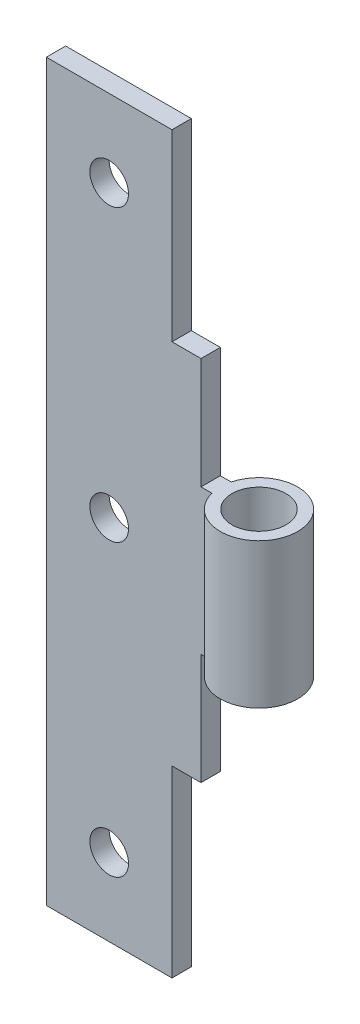
ISO-10303-21;
HEADER;
FILE_DESCRIPTION(('STEP AP214'),'2;1');
FILE_NAME('part.step','',(''),(''),'','','');
FILE_SCHEMA(('AUTOMOTIVE_DESIGN { 1 0 10303 214 1 1 1 1 }'));
ENDSEC;
DATA;
#1=APPLICATION_CONTEXT('core data for automotive mechanical design processes');
#2=APPLICATION_PROTOCOL_DEFINITION('international standard','automotive_design',2000,#1);
#3=PRODUCT_CONTEXT('',#1,'mechanical');
#4=PRODUCT('Part','Part','',(#3));
#5=PRODUCT_RELATED_PRODUCT_CATEGORY('part','',(#4));
#6=PRODUCT_DEFINITION_FORMATION('','',#4);
#7=PRODUCT_DEFINITION_CONTEXT('part definition',#1,'design');
#8=PRODUCT_DEFINITION('design','',#6,#7);
#9=PRODUCT_DEFINITION_SHAPE('','',#8);
#10=(LENGTH_UNIT() NAMED_UNIT(*) SI_UNIT(.MILLI.,.METRE.));
#11=(NAMED_UNIT(*) PLANE_ANGLE_UNIT() SI_UNIT($,.RADIAN.));
#12=(NAMED_UNIT(*) SI_UNIT($,.STERADIAN.) SOLID_ANGLE_UNIT());
#13=UNCERTAINTY_MEASURE_WITH_UNIT(LENGTH_MEASURE(1.E-05),#10,'distance_accuracy_value','');
#14=(GEOMETRIC_REPRESENTATION_CONTEXT(3) GLOBAL_UNCERTAINTY_ASSIGNED_CONTEXT((#13)) GLOBAL_UNIT_ASSIGNED_CONTEXT((#10,
#11,#12)) REPRESENTATION_CONTEXT('',''));
#15=CARTESIAN_POINT('',(0.,0.,0.));
#16=DIRECTION('',(0.,0.,1.));
#17=DIRECTION('',(1.,0.,0.));
#18=AXIS2_PLACEMENT_3D('',#15,#16,#17);
#19=CARTESIAN_POINT('',(4.25,0.,0.));
#20=DIRECTION('',(0.,1.,0.));
#21=DIRECTION('',(0.,0.,1.));
#22=AXIS2_PLACEMENT_3D('',#19,#20,#21);
#23=PLANE('',#22);
#24=CARTESIAN_POINT('',(4.25,0.,0.));
#25=DIRECTION('',(0.,1.,0.));
#26=DIRECTION('',(0.,0.,1.));
#27=AXIS2_PLACEMENT_3D('',#24,#25,#26);
#28=CIRCLE('',#27,1.4);
#29=CARTESIAN_POINT('',(4.25,0.,1.4));
#30=VERTEX_POINT('',#29);
#31=EDGE_CURVE('E195',#30,#30,#28,.T.);
#32=ORIENTED_EDGE('',*,*,#31,.T.);
#33=EDGE_LOOP('',(#32));
#34=FACE_BOUND('',#33,.T.);
#35=DIRECTION('',(0.,0.,1.));
#36=VECTOR('',#35,1.);
#37=CARTESIAN_POINT('',(1.75,0.,-0.499999999999999));
#38=LINE('',#37,#36);
#39=CARTESIAN_POINT('',(1.75,0.,-0.499999999999998));
#40=VERTEX_POINT('',#39);
#41=CARTESIAN_POINT('',(1.75,0.,0.500000000000001));
#42=VERTEX_POINT('',#41);
#43=EDGE_CURVE('E166',#40,#42,#38,.T.);
#44=ORIENTED_EDGE('',*,*,#43,.F.);
#45=DIRECTION('',(-1.,0.,0.));
#46=VECTOR('',#45,1.);
#47=CARTESIAN_POINT('',(2.31350832689629,0.,-0.499999999999998));
#48=LINE('',#47,#46);
#49=CARTESIAN_POINT('',(2.31350832689629,0.,-0.499999999999998));
#50=VERTEX_POINT('',#49);
#51=EDGE_CURVE('E213',#50,#40,#48,.T.);
#52=ORIENTED_EDGE('',*,*,#51,.F.);
#53=CARTESIAN_POINT('',(4.25,0.,0.));
#54=DIRECTION('',(0.,1.,0.));
#55=DIRECTION('',(0.,0.,1.));
#56=AXIS2_PLACEMENT_3D('',#53,#54,#55);
#57=CIRCLE('',#56,2.);
#58=CARTESIAN_POINT('',(2.31350832689629,0.,0.499999999999998));
#59=VERTEX_POINT('',#58);
#60=EDGE_CURVE('E199',#59,#50,#57,.T.);
#61=ORIENTED_EDGE('',*,*,#60,.F.);
#62=DIRECTION('',(1.,0.,0.));
#63=VECTOR('',#62,1.);
#64=CARTESIAN_POINT('',(2.31350832689629,0.,0.499999999999998));
#65=LINE('',#64,#63);
#66=EDGE_CURVE('E206',#42,#59,#65,.T.);
#67=ORIENTED_EDGE('',*,*,#66,.F.);
#68=EDGE_LOOP('',(#44,#52,#61,#67));
#69=FACE_BOUND('',#68,.T.);
#70=ADVANCED_FACE('F32',(#34,#69),#23,.F.);
#71=CARTESIAN_POINT('',(4.25,7.5,0.));
#72=DIRECTION('',(0.,1.,0.));
#73=DIRECTION('',(0.,0.,1.));
#74=AXIS2_PLACEMENT_3D('',#71,#72,#73);
#75=PLANE('',#74);
#76=DIRECTION('',(0.,0.,-1.));
#77=VECTOR('',#76,1.);
#78=CARTESIAN_POINT('',(1.75,7.5,0.499999999999999));
#79=LINE('',#78,#77);
#80=CARTESIAN_POINT('',(1.75,7.5,0.499999999999998));
#81=VERTEX_POINT('',#80);
#82=CARTESIAN_POINT('',(1.75,7.5,-0.500000000000001));
#83=VERTEX_POINT('',#82);
#84=EDGE_CURVE('E181',#81,#83,#79,.T.);
#85=ORIENTED_EDGE('',*,*,#84,.F.);
#86=DIRECTION('',(1.,0.,0.));
#87=VECTOR('',#86,1.);
#88=CARTESIAN_POINT('',(2.31350832689629,7.5,0.499999999999998));
#89=LINE('',#88,#87);
#90=CARTESIAN_POINT('',(2.31350832689629,7.5,0.499999999999998));
#91=VERTEX_POINT('',#90);
#92=EDGE_CURVE('E208',#81,#91,#89,.T.);
#93=ORIENTED_EDGE('',*,*,#92,.T.);
#94=CARTESIAN_POINT('',(4.25,7.5,0.));
#95=DIRECTION('',(0.,1.,0.));
#96=DIRECTION('',(0.,0.,1.));
#97=AXIS2_PLACEMENT_3D('',#94,#95,#96);
#98=CIRCLE('',#97,2.);
#99=CARTESIAN_POINT('',(2.31350832689629,7.5,-0.499999999999998));
#100=VERTEX_POINT('',#99);
#101=EDGE_CURVE('E202',#91,#100,#98,.T.);
#102=ORIENTED_EDGE('',*,*,#101,.T.);
#103=DIRECTION('',(-1.,0.,0.));
#104=VECTOR('',#103,1.);
#105=CARTESIAN_POINT('',(2.31350832689629,7.5,-0.499999999999998));
#106=LINE('',#105,#104);
#107=EDGE_CURVE('E205',#100,#83,#106,.T.);
#108=ORIENTED_EDGE('',*,*,#107,.T.);
#109=EDGE_LOOP('',(#85,#93,#102,#108));
#110=FACE_BOUND('',#109,.T.);
#111=CARTESIAN_POINT('',(4.25,7.5,0.));
#112=DIRECTION('',(0.,1.,0.));
#113=DIRECTION('',(0.,0.,1.));
#114=AXIS2_PLACEMENT_3D('',#111,#112,#113);
#115=CIRCLE('',#114,1.4);
#116=CARTESIAN_POINT('',(4.25,7.5,1.4));
#117=VERTEX_POINT('',#116);
#118=EDGE_CURVE('E196',#117,#117,#115,.T.);
#119=ORIENTED_EDGE('',*,*,#118,.F.);
#120=EDGE_LOOP('',(#119));
#121=FACE_BOUND('',#120,.T.);
#122=ADVANCED_FACE('F301',(#110,#121),#75,.T.);
#123=CARTESIAN_POINT('',(4.25,7.5,0.));
#124=DIRECTION('',(0.,-1.,0.));
#125=DIRECTION('',(0.,0.,-1.));
#126=AXIS2_PLACEMENT_3D('',#123,#124,#125);
#127=CYLINDRICAL_SURFACE('',#126,2.);
#128=ORIENTED_EDGE('',*,*,#60,.T.);
#129=DIRECTION('',(0.,-1.,0.));
#130=VECTOR('',#129,1.);
#131=CARTESIAN_POINT('',(2.31350832689629,7.5,-0.499999999999998));
#132=LINE('',#131,#130);
#133=EDGE_CURVE('E11',#100,#50,#132,.T.);
#134=ORIENTED_EDGE('',*,*,#133,.F.);
#135=ORIENTED_EDGE('',*,*,#101,.F.);
#136=DIRECTION('',(0.,-1.,0.));
#137=VECTOR('',#136,1.);
#138=CARTESIAN_POINT('',(2.31350832689629,7.5,0.499999999999998));
#139=LINE('',#138,#137);
#140=EDGE_CURVE('E210',#91,#59,#139,.T.);
#141=ORIENTED_EDGE('',*,*,#140,.T.);
#142=EDGE_LOOP('',(#128,#134,#135,#141));
#143=FACE_BOUND('',#142,.T.);
#144=ADVANCED_FACE('F34',(#143),#127,.T.);
#145=CARTESIAN_POINT('',(2.31350832689629,7.5,-0.499999999999998));
#146=DIRECTION('',(0.,0.,1.));
#147=DIRECTION('',(1.,0.,0.));
#148=AXIS2_PLACEMENT_3D('',#145,#146,#147);
#149=PLANE('',#148);
#150=CARTESIAN_POINT('',(-3.,18.75,-0.499999999999999));
#151=DIRECTION('',(0.,0.,1.));
#152=DIRECTION('',(1.,0.,0.));
#153=AXIS2_PLACEMENT_3D('',#150,#151,#152);
#154=CIRCLE('',#153,1.);
#155=CARTESIAN_POINT('',(-2.,18.75,-0.499999999999999));
#156=VERTEX_POINT('',#155);
#157=EDGE_CURVE('E254',#156,#156,#154,.F.);
#158=ORIENTED_EDGE('',*,*,#157,.F.);
#159=EDGE_LOOP('',(#158));
#160=FACE_BOUND('',#159,.T.);
#161=CARTESIAN_POINT('',(-2.99999999999972,3.75,-0.499999999999999));
#162=DIRECTION('',(0.,0.,1.));
#163=DIRECTION('',(1.,0.,0.));
#164=AXIS2_PLACEMENT_3D('',#161,#162,#163);
#165=CIRCLE('',#164,1.);
#166=CARTESIAN_POINT('',(-1.99999999999972,3.75,-0.499999999999999));
#167=VERTEX_POINT('',#166);
#168=EDGE_CURVE('E265',#167,#167,#165,.F.);
#169=ORIENTED_EDGE('',*,*,#168,.F.);
#170=EDGE_LOOP('',(#169));
#171=FACE_BOUND('',#170,.T.);
#172=CARTESIAN_POINT('',(-2.99999999999945,-11.25,-0.499999999999999));
#173=DIRECTION('',(0.,0.,1.));
#174=DIRECTION('',(1.,0.,0.));
#175=AXIS2_PLACEMENT_3D('',#172,#173,#174);
#176=CIRCLE('',#175,1.);
#177=CARTESIAN_POINT('',(-1.99999999999945,-11.25,-0.499999999999999));
#178=VERTEX_POINT('',#177);
#179=EDGE_CURVE('E258',#178,#178,#176,.F.);
#180=ORIENTED_EDGE('',*,*,#179,.F.);
#181=EDGE_LOOP('',(#180));
#182=FACE_BOUND('',#181,.T.);
#183=ORIENTED_EDGE('',*,*,#51,.T.);
#184=DIRECTION('',(0.,1.,0.));
#185=VECTOR('',#184,1.);
#186=CARTESIAN_POINT('',(1.75,-5.75,-0.499999999999999));
#187=LINE('',#186,#185);
#188=CARTESIAN_POINT('',(1.75,-5.75,-0.499999999999999));
#189=VERTEX_POINT('',#188);
#190=EDGE_CURVE('E178',#189,#40,#187,.T.);
#191=ORIENTED_EDGE('',*,*,#190,.F.);
#192=DIRECTION('',(1.,0.,0.));
#193=VECTOR('',#192,1.);
#194=CARTESIAN_POINT('',(-6.25,-5.75,-0.5));
#195=LINE('',#194,#193);
#196=CARTESIAN_POINT('',(0.249999999999999,-5.75,-0.5));
#197=VERTEX_POINT('',#196);
#198=EDGE_CURVE('E167',#197,#189,#195,.T.);
#199=ORIENTED_EDGE('',*,*,#198,.F.);
#200=DIRECTION('',(0.,1.,0.));
#201=VECTOR('',#200,1.);
#202=CARTESIAN_POINT('',(0.249999999999999,-15.25,-0.5));
#203=LINE('',#202,#201);
#204=CARTESIAN_POINT('',(0.249999999999999,-15.25,-0.5));
#205=VERTEX_POINT('',#204);
#206=EDGE_CURVE('E163',#205,#197,#203,.T.);
#207=ORIENTED_EDGE('',*,*,#206,.F.);
#208=DIRECTION('',(1.,0.,0.));
#209=VECTOR('',#208,1.);
#210=CARTESIAN_POINT('',(-6.25,-15.25,-0.5));
#211=LINE('',#210,#209);
#212=CARTESIAN_POINT('',(-6.25,-15.25,-0.5));
#213=VERTEX_POINT('',#212);
#214=EDGE_CURVE('E145',#213,#205,#211,.T.);
#215=ORIENTED_EDGE('',*,*,#214,.F.);
#216=DIRECTION('',(0.,-1.,0.));
#217=VECTOR('',#216,1.);
#218=CARTESIAN_POINT('',(-6.25,7.5,-0.5));
#219=LINE('',#218,#217);
#220=CARTESIAN_POINT('',(-6.25,22.75,-0.5));
#221=VERTEX_POINT('',#220);
#222=EDGE_CURVE('E40',#221,#213,#219,.T.);
#223=ORIENTED_EDGE('',*,*,#222,.F.);
#224=DIRECTION('',(-1.,0.,0.));
#225=VECTOR('',#224,1.);
#226=CARTESIAN_POINT('',(-6.25,22.75,-0.5));
#227=LINE('',#226,#225);
#228=CARTESIAN_POINT('',(0.249999999999999,22.75,-0.5));
#229=VERTEX_POINT('',#228);
#230=EDGE_CURVE('E131',#229,#221,#227,.T.);
#231=ORIENTED_EDGE('',*,*,#230,.F.);
#232=DIRECTION('',(0.,-1.,0.));
#233=VECTOR('',#232,1.);
#234=CARTESIAN_POINT('',(0.249999999999999,22.75,-0.5));
#235=LINE('',#234,#233);
#236=CARTESIAN_POINT('',(0.249999999999999,13.25,-0.5));
#237=VERTEX_POINT('',#236);
#238=EDGE_CURVE('E127',#229,#237,#235,.T.);
#239=ORIENTED_EDGE('',*,*,#238,.T.);
#240=DIRECTION('',(-1.,0.,0.));
#241=VECTOR('',#240,1.);
#242=CARTESIAN_POINT('',(-6.25,13.25,-0.5));
#243=LINE('',#242,#241);
#244=CARTESIAN_POINT('',(1.75,13.25,-0.500000000000001));
#245=VERTEX_POINT('',#244);
#246=EDGE_CURVE('E185',#245,#237,#243,.T.);
#247=ORIENTED_EDGE('',*,*,#246,.F.);
#248=DIRECTION('',(0.,-1.,0.));
#249=VECTOR('',#248,1.);
#250=CARTESIAN_POINT('',(1.75,13.25,-0.500000000000001));
#251=LINE('',#250,#249);
#252=EDGE_CURVE('E187',#245,#83,#251,.T.);
#253=ORIENTED_EDGE('',*,*,#252,.T.);
#254=ORIENTED_EDGE('',*,*,#107,.F.);
#255=ORIENTED_EDGE('',*,*,#133,.T.);
#256=EDGE_LOOP('',(#183,#191,#199,#207,#215,#223,#231,#239,#247,#253,#254,#255));
#257=FACE_BOUND('',#256,.T.);
#258=ADVANCED_FACE('F229',(#160,#171,#182,#257),#149,.F.);
#259=CARTESIAN_POINT('',(-6.25,7.5,-0.5));
#260=DIRECTION('',(1.,0.,0.));
#261=DIRECTION('',(0.,0.,-1.));
#262=AXIS2_PLACEMENT_3D('',#259,#260,#261);
#263=PLANE('',#262);
#264=ORIENTED_EDGE('',*,*,#222,.T.);
#265=DIRECTION('',(0.,0.,-1.));
#266=VECTOR('',#265,1.);
#267=CARTESIAN_POINT('',(-6.25,-15.25,-0.5));
#268=LINE('',#267,#266);
#269=CARTESIAN_POINT('',(-6.25,-15.25,0.5));
#270=VERTEX_POINT('',#269);
#271=EDGE_CURVE('E157',#270,#213,#268,.T.);
#272=ORIENTED_EDGE('',*,*,#271,.F.);
#273=DIRECTION('',(0.,-1.,0.));
#274=VECTOR('',#273,1.);
#275=CARTESIAN_POINT('',(-6.25,7.5,0.5));
#276=LINE('',#275,#274);
#277=CARTESIAN_POINT('',(-6.25,22.75,0.5));
#278=VERTEX_POINT('',#277);
#279=EDGE_CURVE('E219',#278,#270,#276,.T.);
#280=ORIENTED_EDGE('',*,*,#279,.F.);
#281=DIRECTION('',(0.,0.,1.));
#282=VECTOR('',#281,1.);
#283=CARTESIAN_POINT('',(-6.25,22.75,0.5));
#284=LINE('',#283,#282);
#285=EDGE_CURVE('E138',#221,#278,#284,.T.);
#286=ORIENTED_EDGE('',*,*,#285,.F.);
#287=EDGE_LOOP('',(#264,#272,#280,#286));
#288=FACE_BOUND('',#287,.T.);
#289=ADVANCED_FACE('F222',(#288),#263,.F.);
#290=CARTESIAN_POINT('',(2.31350832689629,7.5,0.499999999999998));
#291=DIRECTION('',(0.,0.,-1.));
#292=DIRECTION('',(-1.,0.,0.));
#293=AXIS2_PLACEMENT_3D('',#290,#291,#292);
#294=PLANE('',#293);
#295=CARTESIAN_POINT('',(-3.,18.75,0.499999999999998));
#296=DIRECTION('',(0.,0.,1.));
#297=DIRECTION('',(1.,0.,0.));
#298=AXIS2_PLACEMENT_3D('',#295,#296,#297);
#299=CIRCLE('',#298,1.);
#300=CARTESIAN_POINT('',(-2.,18.75,0.499999999999998));
#301=VERTEX_POINT('',#300);
#302=EDGE_CURVE('E268',#301,#301,#299,.T.);
#303=ORIENTED_EDGE('',*,*,#302,.F.);
#304=EDGE_LOOP('',(#303));
#305=FACE_BOUND('',#304,.T.);
#306=CARTESIAN_POINT('',(-2.99999999999972,3.75,0.499999999999998));
#307=DIRECTION('',(0.,0.,1.));
#308=DIRECTION('',(1.,0.,0.));
#309=AXIS2_PLACEMENT_3D('',#306,#307,#308);
#310=CIRCLE('',#309,1.);
#311=CARTESIAN_POINT('',(-1.99999999999972,3.75,0.499999999999998));
#312=VERTEX_POINT('',#311);
#313=EDGE_CURVE('E261',#312,#312,#310,.T.);
#314=ORIENTED_EDGE('',*,*,#313,.F.);
#315=EDGE_LOOP('',(#314));
#316=FACE_BOUND('',#315,.T.);
#317=CARTESIAN_POINT('',(-2.99999999999945,-11.25,0.499999999999998));
#318=DIRECTION('',(0.,0.,1.));
#319=DIRECTION('',(1.,0.,0.));
#320=AXIS2_PLACEMENT_3D('',#317,#318,#319);
#321=CIRCLE('',#320,1.);
#322=CARTESIAN_POINT('',(-1.99999999999945,-11.25,0.499999999999998));
#323=VERTEX_POINT('',#322);
#324=EDGE_CURVE('E262',#323,#323,#321,.T.);
#325=ORIENTED_EDGE('',*,*,#324,.F.);
#326=EDGE_LOOP('',(#325));
#327=FACE_BOUND('',#326,.T.);
#328=ORIENTED_EDGE('',*,*,#279,.T.);
#329=DIRECTION('',(-1.,0.,0.));
#330=VECTOR('',#329,1.);
#331=CARTESIAN_POINT('',(-6.25,-15.25,0.5));
#332=LINE('',#331,#330);
#333=CARTESIAN_POINT('',(0.249999999999999,-15.25,0.5));
#334=VERTEX_POINT('',#333);
#335=EDGE_CURVE('E154',#334,#270,#332,.T.);
#336=ORIENTED_EDGE('',*,*,#335,.F.);
#337=DIRECTION('',(0.,1.,0.));
#338=VECTOR('',#337,1.);
#339=CARTESIAN_POINT('',(0.249999999999999,-15.25,0.5));
#340=LINE('',#339,#338);
#341=CARTESIAN_POINT('',(0.249999999999999,-5.75,0.5));
#342=VERTEX_POINT('',#341);
#343=EDGE_CURVE('E159',#334,#342,#340,.T.);
#344=ORIENTED_EDGE('',*,*,#343,.T.);
#345=DIRECTION('',(-1.,0.,0.));
#346=VECTOR('',#345,1.);
#347=CARTESIAN_POINT('',(-6.25,-5.75,0.5));
#348=LINE('',#347,#346);
#349=CARTESIAN_POINT('',(1.75,-5.75,0.500000000000001));
#350=VERTEX_POINT('',#349);
#351=EDGE_CURVE('E171',#350,#342,#348,.T.);
#352=ORIENTED_EDGE('',*,*,#351,.F.);
#353=DIRECTION('',(0.,1.,0.));
#354=VECTOR('',#353,1.);
#355=CARTESIAN_POINT('',(1.75,-5.75,0.500000000000001));
#356=LINE('',#355,#354);
#357=EDGE_CURVE('E173',#350,#42,#356,.T.);
#358=ORIENTED_EDGE('',*,*,#357,.T.);
#359=ORIENTED_EDGE('',*,*,#66,.T.);
#360=ORIENTED_EDGE('',*,*,#140,.F.);
#361=ORIENTED_EDGE('',*,*,#92,.F.);
#362=DIRECTION('',(0.,-1.,0.));
#363=VECTOR('',#362,1.);
#364=CARTESIAN_POINT('',(1.75,13.25,0.499999999999999));
#365=LINE('',#364,#363);
#366=CARTESIAN_POINT('',(1.75,13.25,0.499999999999999));
#367=VERTEX_POINT('',#366);
#368=EDGE_CURVE('E192',#367,#81,#365,.T.);
#369=ORIENTED_EDGE('',*,*,#368,.F.);
#370=DIRECTION('',(1.,0.,0.));
#371=VECTOR('',#370,1.);
#372=CARTESIAN_POINT('',(-6.25,13.25,0.5));
#373=LINE('',#372,#371);
#374=CARTESIAN_POINT('',(0.249999999999999,13.25,0.499999999999999));
#375=VERTEX_POINT('',#374);
#376=EDGE_CURVE('E143',#375,#367,#373,.T.);
#377=ORIENTED_EDGE('',*,*,#376,.F.);
#378=DIRECTION('',(0.,-1.,0.));
#379=VECTOR('',#378,1.);
#380=CARTESIAN_POINT('',(0.249999999999999,22.75,0.5));
#381=LINE('',#380,#379);
#382=CARTESIAN_POINT('',(0.249999999999999,22.75,0.5));
#383=VERTEX_POINT('',#382);
#384=EDGE_CURVE('E125',#383,#375,#381,.T.);
#385=ORIENTED_EDGE('',*,*,#384,.F.);
#386=DIRECTION('',(1.,0.,0.));
#387=VECTOR('',#386,1.);
#388=CARTESIAN_POINT('',(-6.25,22.75,0.5));
#389=LINE('',#388,#387);
#390=EDGE_CURVE('E132',#278,#383,#389,.T.);
#391=ORIENTED_EDGE('',*,*,#390,.F.);
#392=EDGE_LOOP('',(#328,#336,#344,#352,#358,#359,#360,#361,#369,#377,#385,#391));
#393=FACE_BOUND('',#392,.T.);
#394=ADVANCED_FACE('F141',(#305,#316,#327,#393),#294,.F.);
#395=CARTESIAN_POINT('',(4.25,7.5,0.));
#396=DIRECTION('',(0.,-1.,0.));
#397=DIRECTION('',(0.,0.,-1.));
#398=AXIS2_PLACEMENT_3D('',#395,#396,#397);
#399=CYLINDRICAL_SURFACE('',#398,1.4);
#400=ORIENTED_EDGE('',*,*,#118,.T.);
#401=EDGE_LOOP('',(#400));
#402=FACE_BOUND('',#401,.T.);
#403=ORIENTED_EDGE('',*,*,#31,.F.);
#404=EDGE_LOOP('',(#403));
#405=FACE_BOUND('',#404,.T.);
#406=ADVANCED_FACE('F281',(#402,#405),#399,.F.);
#407=CARTESIAN_POINT('',(1.75,13.25,0.499999999999999));
#408=DIRECTION('',(-1.,0.,0.));
#409=DIRECTION('',(0.,0.,1.));
#410=AXIS2_PLACEMENT_3D('',#407,#408,#409);
#411=PLANE('',#410);
#412=ORIENTED_EDGE('',*,*,#84,.T.);
#413=ORIENTED_EDGE('',*,*,#252,.F.);
#414=DIRECTION('',(0.,0.,-1.));
#415=VECTOR('',#414,1.);
#416=CARTESIAN_POINT('',(1.75,13.25,0.499999999999999));
#417=LINE('',#416,#415);
#418=EDGE_CURVE('E183',#367,#245,#417,.T.);
#419=ORIENTED_EDGE('',*,*,#418,.F.);
#420=ORIENTED_EDGE('',*,*,#368,.T.);
#421=EDGE_LOOP('',(#412,#413,#419,#420));
#422=FACE_BOUND('',#421,.T.);
#423=ADVANCED_FACE('F250',(#422),#411,.F.);
#424=CARTESIAN_POINT('',(0.,13.25,0.));
#425=DIRECTION('',(0.,1.,0.));
#426=DIRECTION('',(0.,0.,1.));
#427=AXIS2_PLACEMENT_3D('',#424,#425,#426);
#428=PLANE('',#427);
#429=DIRECTION('',(0.,0.,-1.));
#430=VECTOR('',#429,1.);
#431=CARTESIAN_POINT('',(0.249999999999999,13.25,0.5));
#432=LINE('',#431,#430);
#433=EDGE_CURVE('E47',#375,#237,#432,.T.);
#434=ORIENTED_EDGE('',*,*,#433,.F.);
#435=ORIENTED_EDGE('',*,*,#376,.T.);
#436=ORIENTED_EDGE('',*,*,#418,.T.);
#437=ORIENTED_EDGE('',*,*,#246,.T.);
#438=EDGE_LOOP('',(#434,#435,#436,#437));
#439=FACE_BOUND('',#438,.T.);
#440=ADVANCED_FACE('F253',(#439),#428,.T.);
#441=CARTESIAN_POINT('',(1.75,-5.75,-0.499999999999999));
#442=DIRECTION('',(-1.,0.,0.));
#443=DIRECTION('',(0.,0.,1.));
#444=AXIS2_PLACEMENT_3D('',#441,#442,#443);
#445=PLANE('',#444);
#446=ORIENTED_EDGE('',*,*,#43,.T.);
#447=ORIENTED_EDGE('',*,*,#357,.F.);
#448=DIRECTION('',(0.,0.,1.));
#449=VECTOR('',#448,1.);
#450=CARTESIAN_POINT('',(1.75,-5.75,-0.499999999999999));
#451=LINE('',#450,#449);
#452=EDGE_CURVE('E169',#189,#350,#451,.T.);
#453=ORIENTED_EDGE('',*,*,#452,.F.);
#454=ORIENTED_EDGE('',*,*,#190,.T.);
#455=EDGE_LOOP('',(#446,#447,#453,#454));
#456=FACE_BOUND('',#455,.T.);
#457=ADVANCED_FACE('F239',(#456),#445,.F.);
#458=CARTESIAN_POINT('',(0.,-5.75,0.));
#459=DIRECTION('',(0.,-1.,0.));
#460=DIRECTION('',(0.,0.,-1.));
#461=AXIS2_PLACEMENT_3D('',#458,#459,#460);
#462=PLANE('',#461);
#463=DIRECTION('',(0.,0.,1.));
#464=VECTOR('',#463,1.);
#465=CARTESIAN_POINT('',(0.249999999999999,-5.75,-0.5));
#466=LINE('',#465,#464);
#467=EDGE_CURVE('E55',#197,#342,#466,.T.);
#468=ORIENTED_EDGE('',*,*,#467,.F.);
#469=ORIENTED_EDGE('',*,*,#198,.T.);
#470=ORIENTED_EDGE('',*,*,#452,.T.);
#471=ORIENTED_EDGE('',*,*,#351,.T.);
#472=EDGE_LOOP('',(#468,#469,#470,#471));
#473=FACE_BOUND('',#472,.T.);
#474=ADVANCED_FACE('F236',(#473),#462,.T.);
#475=CARTESIAN_POINT('',(0.249999999999999,-15.25,-0.5));
#476=DIRECTION('',(-1.,0.,0.));
#477=DIRECTION('',(0.,0.,1.));
#478=AXIS2_PLACEMENT_3D('',#475,#476,#477);
#479=PLANE('',#478);
#480=ORIENTED_EDGE('',*,*,#467,.T.);
#481=ORIENTED_EDGE('',*,*,#343,.F.);
#482=DIRECTION('',(0.,0.,1.));
#483=VECTOR('',#482,1.);
#484=CARTESIAN_POINT('',(0.249999999999999,-15.25,-0.5));
#485=LINE('',#484,#483);
#486=EDGE_CURVE('E152',#205,#334,#485,.T.);
#487=ORIENTED_EDGE('',*,*,#486,.F.);
#488=ORIENTED_EDGE('',*,*,#206,.T.);
#489=EDGE_LOOP('',(#480,#481,#487,#488));
#490=FACE_BOUND('',#489,.T.);
#491=ADVANCED_FACE('F232',(#490),#479,.F.);
#492=CARTESIAN_POINT('',(0.,-15.25,0.));
#493=DIRECTION('',(0.,-1.,0.));
#494=DIRECTION('',(0.,0.,-1.));
#495=AXIS2_PLACEMENT_3D('',#492,#493,#494);
#496=PLANE('',#495);
#497=ORIENTED_EDGE('',*,*,#214,.T.);
#498=ORIENTED_EDGE('',*,*,#486,.T.);
#499=ORIENTED_EDGE('',*,*,#335,.T.);
#500=ORIENTED_EDGE('',*,*,#271,.T.);
#501=EDGE_LOOP('',(#497,#498,#499,#500));
#502=FACE_BOUND('',#501,.T.);
#503=ADVANCED_FACE('F226',(#502),#496,.T.);
#504=CARTESIAN_POINT('',(0.249999999999999,22.75,0.5));
#505=DIRECTION('',(-1.,0.,0.));
#506=DIRECTION('',(0.,0.,1.));
#507=AXIS2_PLACEMENT_3D('',#504,#505,#506);
#508=PLANE('',#507);
#509=ORIENTED_EDGE('',*,*,#433,.T.);
#510=ORIENTED_EDGE('',*,*,#238,.F.);
#511=DIRECTION('',(0.,0.,-1.));
#512=VECTOR('',#511,1.);
#513=CARTESIAN_POINT('',(0.249999999999999,22.75,0.5));
#514=LINE('',#513,#512);
#515=EDGE_CURVE('E121',#383,#229,#514,.T.);
#516=ORIENTED_EDGE('',*,*,#515,.F.);
#517=ORIENTED_EDGE('',*,*,#384,.T.);
#518=EDGE_LOOP('',(#509,#510,#516,#517));
#519=FACE_BOUND('',#518,.T.);
#520=ADVANCED_FACE('F123',(#519),#508,.F.);
#521=CARTESIAN_POINT('',(0.,22.75,0.));
#522=DIRECTION('',(0.,1.,0.));
#523=DIRECTION('',(0.,0.,1.));
#524=AXIS2_PLACEMENT_3D('',#521,#522,#523);
#525=PLANE('',#524);
#526=ORIENTED_EDGE('',*,*,#390,.T.);
#527=ORIENTED_EDGE('',*,*,#515,.T.);
#528=ORIENTED_EDGE('',*,*,#230,.T.);
#529=ORIENTED_EDGE('',*,*,#285,.T.);
#530=EDGE_LOOP('',(#526,#527,#528,#529));
#531=FACE_BOUND('',#530,.T.);
#532=ADVANCED_FACE('F136',(#531),#525,.T.);
#533=CARTESIAN_POINT('',(-2.99999999999945,-11.25,-2.001));
#534=DIRECTION('',(0.,0.,1.));
#535=DIRECTION('',(1.,0.,0.));
#536=AXIS2_PLACEMENT_3D('',#533,#534,#535);
#537=CYLINDRICAL_SURFACE('',#536,1.);
#538=ORIENTED_EDGE('',*,*,#324,.T.);
#539=EDGE_LOOP('',(#538));
#540=FACE_BOUND('',#539,.T.);
#541=ORIENTED_EDGE('',*,*,#179,.T.);
#542=EDGE_LOOP('',(#541));
#543=FACE_BOUND('',#542,.T.);
#544=ADVANCED_FACE('F287',(#540,#543),#537,.F.);
#545=CARTESIAN_POINT('',(-2.99999999999972,3.75,-2.001));
#546=DIRECTION('',(0.,0.,1.));
#547=DIRECTION('',(1.,0.,0.));
#548=AXIS2_PLACEMENT_3D('',#545,#546,#547);
#549=CYLINDRICAL_SURFACE('',#548,1.);
#550=ORIENTED_EDGE('',*,*,#313,.T.);
#551=EDGE_LOOP('',(#550));
#552=FACE_BOUND('',#551,.T.);
#553=ORIENTED_EDGE('',*,*,#168,.T.);
#554=EDGE_LOOP('',(#553));
#555=FACE_BOUND('',#554,.T.);
#556=ADVANCED_FACE('F290',(#552,#555),#549,.F.);
#557=CARTESIAN_POINT('',(-3.,18.75,-2.001));
#558=DIRECTION('',(0.,0.,1.));
#559=DIRECTION('',(1.,0.,0.));
#560=AXIS2_PLACEMENT_3D('',#557,#558,#559);
#561=CYLINDRICAL_SURFACE('',#560,1.);
#562=ORIENTED_EDGE('',*,*,#302,.T.);
#563=EDGE_LOOP('',(#562));
#564=FACE_BOUND('',#563,.T.);
#565=ORIENTED_EDGE('',*,*,#157,.T.);
#566=EDGE_LOOP('',(#565));
#567=FACE_BOUND('',#566,.T.);
#568=ADVANCED_FACE('F276',(#564,#567),#561,.F.);
#569=CLOSED_SHELL('',(#70,#122,#144,#258,#289,#394,#406,#423,#440,#457,#474,#491,#503,#520,#532,
#544,#556,#568));
#570=MANIFOLD_SOLID_BREP('B2',#569);
#571=ADVANCED_BREP_SHAPE_REPRESENTATION('',(#18,#570),#14);
#572=SHAPE_DEFINITION_REPRESENTATION(#9,#571);
ENDSEC;
END-ISO-10303-21;
